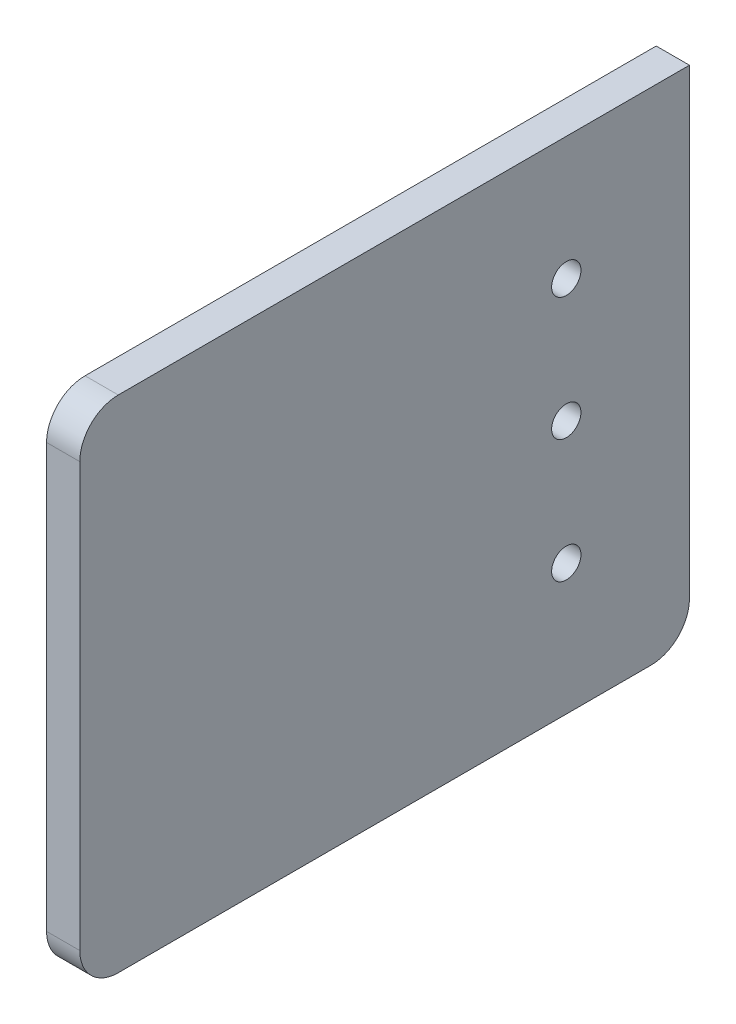
ISO-10303-21;
HEADER;
FILE_DESCRIPTION(('STEP AP214'),'2;1');
FILE_NAME('part.step','',(''),(''),'','','');
FILE_SCHEMA(('AUTOMOTIVE_DESIGN { 1 0 10303 214 1 1 1 1 }'));
ENDSEC;
DATA;
#1=APPLICATION_CONTEXT('core data for automotive mechanical design processes');
#2=APPLICATION_PROTOCOL_DEFINITION('international standard','automotive_design',2000,#1);
#3=PRODUCT_CONTEXT('',#1,'mechanical');
#4=PRODUCT('Part','Part','',(#3));
#5=PRODUCT_RELATED_PRODUCT_CATEGORY('part','',(#4));
#6=PRODUCT_DEFINITION_FORMATION('','',#4);
#7=PRODUCT_DEFINITION_CONTEXT('part definition',#1,'design');
#8=PRODUCT_DEFINITION('design','',#6,#7);
#9=PRODUCT_DEFINITION_SHAPE('','',#8);
#10=(LENGTH_UNIT() NAMED_UNIT(*) SI_UNIT(.MILLI.,.METRE.));
#11=(NAMED_UNIT(*) PLANE_ANGLE_UNIT() SI_UNIT($,.RADIAN.));
#12=(NAMED_UNIT(*) SI_UNIT($,.STERADIAN.) SOLID_ANGLE_UNIT());
#13=UNCERTAINTY_MEASURE_WITH_UNIT(LENGTH_MEASURE(1.E-05),#10,'distance_accuracy_value','');
#14=(GEOMETRIC_REPRESENTATION_CONTEXT(3) GLOBAL_UNCERTAINTY_ASSIGNED_CONTEXT((#13)) GLOBAL_UNIT_ASSIGNED_CONTEXT((#10,
#11,#12)) REPRESENTATION_CONTEXT('',''));
#15=CARTESIAN_POINT('',(0.,0.,0.));
#16=DIRECTION('',(0.,0.,1.));
#17=DIRECTION('',(1.,0.,0.));
#18=AXIS2_PLACEMENT_3D('',#15,#16,#17);
#19=CARTESIAN_POINT('',(4.318,0.,0.));
#20=DIRECTION('',(-1.,0.,0.));
#21=DIRECTION('',(0.,0.,1.));
#22=AXIS2_PLACEMENT_3D('',#19,#20,#21);
#23=PLANE('',#22);
#24=DIRECTION('',(0.,0.,-1.));
#25=VECTOR('',#24,1.);
#26=CARTESIAN_POINT('',(4.318,0.,0.));
#27=LINE('',#26,#25);
#28=CARTESIAN_POINT('',(4.318,0.,-5.));
#29=VERTEX_POINT('',#28);
#30=CARTESIAN_POINT('',(4.318,0.,-74.1959594928933));
#31=VERTEX_POINT('',#30);
#32=EDGE_CURVE('E104',#29,#31,#27,.T.);
#33=ORIENTED_EDGE('',*,*,#32,.T.);
#34=CARTESIAN_POINT('',(4.318,5.,-74.1959594928933));
#35=DIRECTION('',(-1.,0.,0.));
#36=DIRECTION('',(0.,0.,1.));
#37=AXIS2_PLACEMENT_3D('',#34,#35,#36);
#38=CIRCLE('',#37,5.);
#39=CARTESIAN_POINT('',(4.318,5.,-79.1959594928933));
#40=VERTEX_POINT('',#39);
#41=EDGE_CURVE('E100',#31,#40,#38,.F.);
#42=ORIENTED_EDGE('',*,*,#41,.T.);
#43=DIRECTION('',(0.,1.,0.));
#44=VECTOR('',#43,1.);
#45=CARTESIAN_POINT('',(4.318,0.,-79.1959594928933));
#46=LINE('',#45,#44);
#47=CARTESIAN_POINT('',(4.318,65.,-79.1959594928933));
#48=VERTEX_POINT('',#47);
#49=EDGE_CURVE('E93',#40,#48,#46,.T.);
#50=ORIENTED_EDGE('',*,*,#49,.T.);
#51=DIRECTION('',(0.,0.,1.));
#52=VECTOR('',#51,1.);
#53=CARTESIAN_POINT('',(4.318,65.,0.));
#54=LINE('',#53,#52);
#55=CARTESIAN_POINT('',(4.318,65.,-5.));
#56=VERTEX_POINT('',#55);
#57=EDGE_CURVE('E97',#48,#56,#54,.T.);
#58=ORIENTED_EDGE('',*,*,#57,.T.);
#59=CARTESIAN_POINT('',(4.318,60.,-5.));
#60=DIRECTION('',(-1.,0.,0.));
#61=DIRECTION('',(0.,0.,1.));
#62=AXIS2_PLACEMENT_3D('',#59,#60,#61);
#63=CIRCLE('',#62,5.);
#64=CARTESIAN_POINT('',(4.318,60.,0.));
#65=VERTEX_POINT('',#64);
#66=EDGE_CURVE('E142',#56,#65,#63,.F.);
#67=ORIENTED_EDGE('',*,*,#66,.T.);
#68=DIRECTION('',(0.,-1.,0.));
#69=VECTOR('',#68,1.);
#70=CARTESIAN_POINT('',(4.318,0.,0.));
#71=LINE('',#70,#69);
#72=CARTESIAN_POINT('',(4.318,5.,0.));
#73=VERTEX_POINT('',#72);
#74=EDGE_CURVE('E126',#65,#73,#71,.T.);
#75=ORIENTED_EDGE('',*,*,#74,.T.);
#76=CARTESIAN_POINT('',(4.318,5.,-5.));
#77=DIRECTION('',(-1.,0.,0.));
#78=DIRECTION('',(0.,0.,1.));
#79=AXIS2_PLACEMENT_3D('',#76,#77,#78);
#80=CIRCLE('',#79,5.);
#81=EDGE_CURVE('E140',#73,#29,#80,.F.);
#82=ORIENTED_EDGE('',*,*,#81,.T.);
#83=EDGE_LOOP('',(#33,#42,#50,#58,#67,#75,#82));
#84=FACE_BOUND('',#83,.T.);
#85=CARTESIAN_POINT('',(4.318,49.,-63.1959594928933));
#86=DIRECTION('',(1.,0.,0.));
#87=DIRECTION('',(0.,0.,-1.));
#88=AXIS2_PLACEMENT_3D('',#85,#86,#87);
#89=CIRCLE('',#88,1.90500000000001);
#90=CARTESIAN_POINT('',(4.318,49.,-65.1009594928933));
#91=VERTEX_POINT('',#90);
#92=EDGE_CURVE('E121',#91,#91,#89,.T.);
#93=ORIENTED_EDGE('',*,*,#92,.F.);
#94=EDGE_LOOP('',(#93));
#95=FACE_BOUND('',#94,.T.);
#96=CARTESIAN_POINT('',(4.318,33.,-63.1959594928933));
#97=DIRECTION('',(1.,0.,0.));
#98=DIRECTION('',(0.,0.,-1.));
#99=AXIS2_PLACEMENT_3D('',#96,#97,#98);
#100=CIRCLE('',#99,1.90500000000001);
#101=CARTESIAN_POINT('',(4.318,33.,-65.1009594928933));
#102=VERTEX_POINT('',#101);
#103=EDGE_CURVE('E166',#102,#102,#100,.T.);
#104=ORIENTED_EDGE('',*,*,#103,.F.);
#105=EDGE_LOOP('',(#104));
#106=FACE_BOUND('',#105,.T.);
#107=CARTESIAN_POINT('',(4.318,17.,-63.1959594928933));
#108=DIRECTION('',(1.,0.,0.));
#109=DIRECTION('',(0.,0.,-1.));
#110=AXIS2_PLACEMENT_3D('',#107,#108,#109);
#111=CIRCLE('',#110,1.90500000000001);
#112=CARTESIAN_POINT('',(4.318,17.,-65.1009594928933));
#113=VERTEX_POINT('',#112);
#114=EDGE_CURVE('E172',#113,#113,#111,.T.);
#115=ORIENTED_EDGE('',*,*,#114,.F.);
#116=EDGE_LOOP('',(#115));
#117=FACE_BOUND('',#116,.T.);
#118=ADVANCED_FACE('F33',(#84,#95,#106,#117),#23,.F.);
#119=CARTESIAN_POINT('',(0.,0.,0.));
#120=DIRECTION('',(-1.,0.,0.));
#121=DIRECTION('',(0.,0.,1.));
#122=AXIS2_PLACEMENT_3D('',#119,#120,#121);
#123=PLANE('',#122);
#124=CARTESIAN_POINT('',(0.,33.,-63.1959594928933));
#125=DIRECTION('',(1.,0.,0.));
#126=DIRECTION('',(0.,0.,-1.));
#127=AXIS2_PLACEMENT_3D('',#124,#125,#126);
#128=CIRCLE('',#127,1.90500000000001);
#129=CARTESIAN_POINT('',(0.,33.,-65.1009594928933));
#130=VERTEX_POINT('',#129);
#131=EDGE_CURVE('E169',#130,#130,#128,.T.);
#132=ORIENTED_EDGE('',*,*,#131,.T.);
#133=EDGE_LOOP('',(#132));
#134=FACE_BOUND('',#133,.T.);
#135=DIRECTION('',(0.,1.,0.));
#136=VECTOR('',#135,1.);
#137=CARTESIAN_POINT('',(0.,0.,-79.1959594928933));
#138=LINE('',#137,#136);
#139=CARTESIAN_POINT('',(0.,5.,-79.1959594928933));
#140=VERTEX_POINT('',#139);
#141=CARTESIAN_POINT('',(0.,65.,-79.1959594928933));
#142=VERTEX_POINT('',#141);
#143=EDGE_CURVE('E110',#140,#142,#138,.T.);
#144=ORIENTED_EDGE('',*,*,#143,.F.);
#145=CARTESIAN_POINT('',(0.,5.,-74.1959594928933));
#146=DIRECTION('',(-1.,0.,0.));
#147=DIRECTION('',(0.,0.,1.));
#148=AXIS2_PLACEMENT_3D('',#145,#146,#147);
#149=CIRCLE('',#148,5.);
#150=CARTESIAN_POINT('',(0.,0.,-74.1959594928933));
#151=VERTEX_POINT('',#150);
#152=EDGE_CURVE('E133',#140,#151,#149,.T.);
#153=ORIENTED_EDGE('',*,*,#152,.T.);
#154=DIRECTION('',(0.,0.,-1.));
#155=VECTOR('',#154,1.);
#156=CARTESIAN_POINT('',(0.,0.,0.));
#157=LINE('',#156,#155);
#158=CARTESIAN_POINT('',(0.,0.,-5.));
#159=VERTEX_POINT('',#158);
#160=EDGE_CURVE('E120',#159,#151,#157,.T.);
#161=ORIENTED_EDGE('',*,*,#160,.F.);
#162=CARTESIAN_POINT('',(0.,5.,-5.));
#163=DIRECTION('',(-1.,0.,0.));
#164=DIRECTION('',(0.,0.,1.));
#165=AXIS2_PLACEMENT_3D('',#162,#163,#164);
#166=CIRCLE('',#165,5.);
#167=CARTESIAN_POINT('',(0.,5.,0.));
#168=VERTEX_POINT('',#167);
#169=EDGE_CURVE('E129',#159,#168,#166,.T.);
#170=ORIENTED_EDGE('',*,*,#169,.T.);
#171=DIRECTION('',(0.,-1.,0.));
#172=VECTOR('',#171,1.);
#173=CARTESIAN_POINT('',(0.,0.,0.));
#174=LINE('',#173,#172);
#175=CARTESIAN_POINT('',(0.,60.,0.));
#176=VERTEX_POINT('',#175);
#177=EDGE_CURVE('E118',#176,#168,#174,.T.);
#178=ORIENTED_EDGE('',*,*,#177,.F.);
#179=CARTESIAN_POINT('',(0.,60.,-5.));
#180=DIRECTION('',(-1.,0.,0.));
#181=DIRECTION('',(0.,0.,1.));
#182=AXIS2_PLACEMENT_3D('',#179,#180,#181);
#183=CIRCLE('',#182,5.);
#184=CARTESIAN_POINT('',(0.,65.,-5.));
#185=VERTEX_POINT('',#184);
#186=EDGE_CURVE('E131',#176,#185,#183,.T.);
#187=ORIENTED_EDGE('',*,*,#186,.T.);
#188=DIRECTION('',(0.,0.,1.));
#189=VECTOR('',#188,1.);
#190=CARTESIAN_POINT('',(0.,65.,0.));
#191=LINE('',#190,#189);
#192=EDGE_CURVE('E125',#142,#185,#191,.T.);
#193=ORIENTED_EDGE('',*,*,#192,.F.);
#194=EDGE_LOOP('',(#144,#153,#161,#170,#178,#187,#193));
#195=FACE_BOUND('',#194,.T.);
#196=CARTESIAN_POINT('',(0.,49.,-63.1959594928933));
#197=DIRECTION('',(1.,0.,0.));
#198=DIRECTION('',(0.,0.,-1.));
#199=AXIS2_PLACEMENT_3D('',#196,#197,#198);
#200=CIRCLE('',#199,1.90500000000001);
#201=CARTESIAN_POINT('',(0.,49.,-65.1009594928933));
#202=VERTEX_POINT('',#201);
#203=EDGE_CURVE('E163',#202,#202,#200,.T.);
#204=ORIENTED_EDGE('',*,*,#203,.T.);
#205=EDGE_LOOP('',(#204));
#206=FACE_BOUND('',#205,.T.);
#207=CARTESIAN_POINT('',(0.,17.,-63.1959594928933));
#208=DIRECTION('',(1.,0.,0.));
#209=DIRECTION('',(0.,0.,-1.));
#210=AXIS2_PLACEMENT_3D('',#207,#208,#209);
#211=CIRCLE('',#210,1.90500000000001);
#212=CARTESIAN_POINT('',(0.,17.,-65.1009594928933));
#213=VERTEX_POINT('',#212);
#214=EDGE_CURVE('E175',#213,#213,#211,.T.);
#215=ORIENTED_EDGE('',*,*,#214,.T.);
#216=EDGE_LOOP('',(#215));
#217=FACE_BOUND('',#216,.T.);
#218=ADVANCED_FACE('F151',(#134,#195,#206,#217),#123,.T.);
#219=CARTESIAN_POINT('',(4.318,0.,0.));
#220=DIRECTION('',(0.,0.,-1.));
#221=DIRECTION('',(-1.,0.,0.));
#222=AXIS2_PLACEMENT_3D('',#219,#220,#221);
#223=PLANE('',#222);
#224=ORIENTED_EDGE('',*,*,#74,.F.);
#225=DIRECTION('',(-1.,0.,0.));
#226=VECTOR('',#225,1.);
#227=CARTESIAN_POINT('',(4.318,60.,0.));
#228=LINE('',#227,#226);
#229=EDGE_CURVE('E41',#65,#176,#228,.T.);
#230=ORIENTED_EDGE('',*,*,#229,.T.);
#231=ORIENTED_EDGE('',*,*,#177,.T.);
#232=DIRECTION('',(-1.,0.,0.));
#233=VECTOR('',#232,1.);
#234=CARTESIAN_POINT('',(4.318,5.,0.));
#235=LINE('',#234,#233);
#236=EDGE_CURVE('E54',#168,#73,#235,.F.);
#237=ORIENTED_EDGE('',*,*,#236,.T.);
#238=EDGE_LOOP('',(#224,#230,#231,#237));
#239=FACE_BOUND('',#238,.T.);
#240=ADVANCED_FACE('F148',(#239),#223,.F.);
#241=CARTESIAN_POINT('',(4.318,0.,0.));
#242=DIRECTION('',(0.,1.,0.));
#243=DIRECTION('',(0.,0.,1.));
#244=AXIS2_PLACEMENT_3D('',#241,#242,#243);
#245=PLANE('',#244);
#246=ORIENTED_EDGE('',*,*,#160,.T.);
#247=DIRECTION('',(-1.,0.,0.));
#248=VECTOR('',#247,1.);
#249=CARTESIAN_POINT('',(4.318,0.,-74.1959594928933));
#250=LINE('',#249,#248);
#251=EDGE_CURVE('E138',#151,#31,#250,.F.);
#252=ORIENTED_EDGE('',*,*,#251,.T.);
#253=ORIENTED_EDGE('',*,*,#32,.F.);
#254=DIRECTION('',(-1.,0.,0.));
#255=VECTOR('',#254,1.);
#256=CARTESIAN_POINT('',(4.318,0.,-5.));
#257=LINE('',#256,#255);
#258=EDGE_CURVE('E135',#29,#159,#257,.T.);
#259=ORIENTED_EDGE('',*,*,#258,.T.);
#260=EDGE_LOOP('',(#246,#252,#253,#259));
#261=FACE_BOUND('',#260,.T.);
#262=ADVANCED_FACE('F159',(#261),#245,.F.);
#263=CARTESIAN_POINT('',(4.318,0.,-79.1959594928933));
#264=DIRECTION('',(0.,0.,1.));
#265=DIRECTION('',(1.,0.,0.));
#266=AXIS2_PLACEMENT_3D('',#263,#264,#265);
#267=PLANE('',#266);
#268=ORIENTED_EDGE('',*,*,#49,.F.);
#269=DIRECTION('',(-1.,0.,0.));
#270=VECTOR('',#269,1.);
#271=CARTESIAN_POINT('',(4.318,5.,-79.1959594928933));
#272=LINE('',#271,#270);
#273=EDGE_CURVE('E112',#40,#140,#272,.T.);
#274=ORIENTED_EDGE('',*,*,#273,.T.);
#275=ORIENTED_EDGE('',*,*,#143,.T.);
#276=DIRECTION('',(-1.,0.,0.));
#277=VECTOR('',#276,1.);
#278=CARTESIAN_POINT('',(4.318,65.,-79.1959594928933));
#279=LINE('',#278,#277);
#280=EDGE_CURVE('E107',#48,#142,#279,.T.);
#281=ORIENTED_EDGE('',*,*,#280,.F.);
#282=EDGE_LOOP('',(#268,#274,#275,#281));
#283=FACE_BOUND('',#282,.T.);
#284=ADVANCED_FACE('F108',(#283),#267,.F.);
#285=CARTESIAN_POINT('',(4.318,65.,0.));
#286=DIRECTION('',(0.,-1.,0.));
#287=DIRECTION('',(0.,0.,-1.));
#288=AXIS2_PLACEMENT_3D('',#285,#286,#287);
#289=PLANE('',#288);
#290=ORIENTED_EDGE('',*,*,#192,.T.);
#291=DIRECTION('',(-1.,0.,0.));
#292=VECTOR('',#291,1.);
#293=CARTESIAN_POINT('',(4.318,65.,-5.));
#294=LINE('',#293,#292);
#295=EDGE_CURVE('E11',#185,#56,#294,.F.);
#296=ORIENTED_EDGE('',*,*,#295,.T.);
#297=ORIENTED_EDGE('',*,*,#57,.F.);
#298=ORIENTED_EDGE('',*,*,#280,.T.);
#299=EDGE_LOOP('',(#290,#296,#297,#298));
#300=FACE_BOUND('',#299,.T.);
#301=ADVANCED_FACE('F114',(#300),#289,.F.);
#302=CARTESIAN_POINT('',(4.318,49.,-63.1959594928933));
#303=DIRECTION('',(-1.,0.,0.));
#304=DIRECTION('',(0.,0.,1.));
#305=AXIS2_PLACEMENT_3D('',#302,#303,#304);
#306=CYLINDRICAL_SURFACE('',#305,1.90500000000001);
#307=ORIENTED_EDGE('',*,*,#92,.T.);
#308=EDGE_LOOP('',(#307));
#309=FACE_BOUND('',#308,.T.);
#310=ORIENTED_EDGE('',*,*,#203,.F.);
#311=EDGE_LOOP('',(#310));
#312=FACE_BOUND('',#311,.T.);
#313=ADVANCED_FACE('F192',(#309,#312),#306,.F.);
#314=CARTESIAN_POINT('',(4.318,33.,-63.1959594928933));
#315=DIRECTION('',(-1.,0.,0.));
#316=DIRECTION('',(0.,0.,1.));
#317=AXIS2_PLACEMENT_3D('',#314,#315,#316);
#318=CYLINDRICAL_SURFACE('',#317,1.90500000000001);
#319=ORIENTED_EDGE('',*,*,#103,.T.);
#320=EDGE_LOOP('',(#319));
#321=FACE_BOUND('',#320,.T.);
#322=ORIENTED_EDGE('',*,*,#131,.F.);
#323=EDGE_LOOP('',(#322));
#324=FACE_BOUND('',#323,.T.);
#325=ADVANCED_FACE('F268',(#321,#324),#318,.F.);
#326=CARTESIAN_POINT('',(4.318,17.,-63.1959594928933));
#327=DIRECTION('',(-1.,0.,0.));
#328=DIRECTION('',(0.,0.,1.));
#329=AXIS2_PLACEMENT_3D('',#326,#327,#328);
#330=CYLINDRICAL_SURFACE('',#329,1.90500000000001);
#331=ORIENTED_EDGE('',*,*,#114,.T.);
#332=EDGE_LOOP('',(#331));
#333=FACE_BOUND('',#332,.T.);
#334=ORIENTED_EDGE('',*,*,#214,.F.);
#335=EDGE_LOOP('',(#334));
#336=FACE_BOUND('',#335,.T.);
#337=ADVANCED_FACE('F181',(#333,#336),#330,.F.);
#338=CARTESIAN_POINT('',(4.318,5.,-74.1959594928933));
#339=DIRECTION('',(-1.,0.,0.));
#340=DIRECTION('',(0.,0.,1.));
#341=AXIS2_PLACEMENT_3D('',#338,#339,#340);
#342=CYLINDRICAL_SURFACE('',#341,5.);
#343=ORIENTED_EDGE('',*,*,#41,.F.);
#344=ORIENTED_EDGE('',*,*,#251,.F.);
#345=ORIENTED_EDGE('',*,*,#152,.F.);
#346=ORIENTED_EDGE('',*,*,#273,.F.);
#347=EDGE_LOOP('',(#343,#344,#345,#346));
#348=FACE_BOUND('',#347,.T.);
#349=ADVANCED_FACE('F203',(#348),#342,.T.);
#350=CARTESIAN_POINT('',(4.318,60.,-5.));
#351=DIRECTION('',(-1.,0.,0.));
#352=DIRECTION('',(0.,0.,1.));
#353=AXIS2_PLACEMENT_3D('',#350,#351,#352);
#354=CYLINDRICAL_SURFACE('',#353,5.);
#355=ORIENTED_EDGE('',*,*,#66,.F.);
#356=ORIENTED_EDGE('',*,*,#295,.F.);
#357=ORIENTED_EDGE('',*,*,#186,.F.);
#358=ORIENTED_EDGE('',*,*,#229,.F.);
#359=EDGE_LOOP('',(#355,#356,#357,#358));
#360=FACE_BOUND('',#359,.T.);
#361=ADVANCED_FACE('F205',(#360),#354,.T.);
#362=CARTESIAN_POINT('',(4.318,5.,-5.));
#363=DIRECTION('',(-1.,0.,0.));
#364=DIRECTION('',(0.,0.,1.));
#365=AXIS2_PLACEMENT_3D('',#362,#363,#364);
#366=CYLINDRICAL_SURFACE('',#365,5.);
#367=ORIENTED_EDGE('',*,*,#81,.F.);
#368=ORIENTED_EDGE('',*,*,#236,.F.);
#369=ORIENTED_EDGE('',*,*,#169,.F.);
#370=ORIENTED_EDGE('',*,*,#258,.F.);
#371=EDGE_LOOP('',(#367,#368,#369,#370));
#372=FACE_BOUND('',#371,.T.);
#373=ADVANCED_FACE('F35',(#372),#366,.T.);
#374=CLOSED_SHELL('',(#118,#218,#240,#262,#284,#301,#313,#325,#337,#349,#361,#373));
#375=MANIFOLD_SOLID_BREP('B2',#374);
#376=ADVANCED_BREP_SHAPE_REPRESENTATION('',(#18,#375),#14);
#377=SHAPE_DEFINITION_REPRESENTATION(#9,#376);
ENDSEC;
END-ISO-10303-21;
